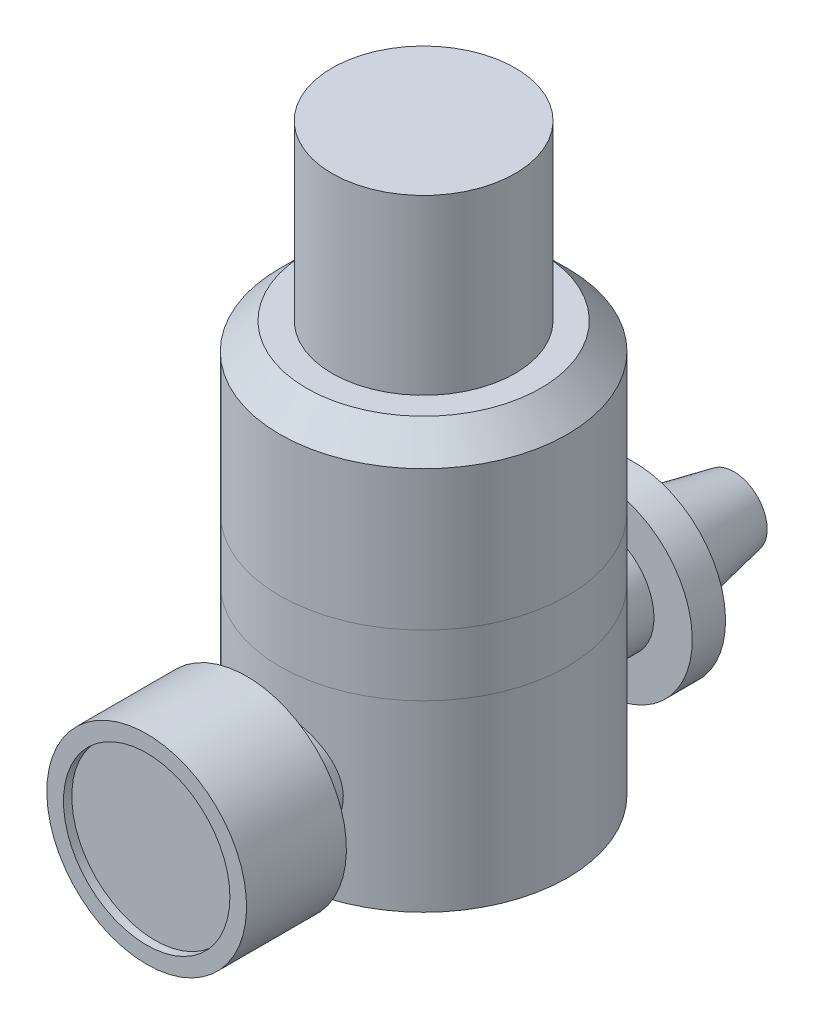
ISO-10303-21;
HEADER;
FILE_DESCRIPTION(('STEP AP214'),'2;1');
FILE_NAME('part.step','',(''),(''),'','','');
FILE_SCHEMA(('AUTOMOTIVE_DESIGN { 1 0 10303 214 1 1 1 1 }'));
ENDSEC;
DATA;
#1=APPLICATION_CONTEXT('core data for automotive mechanical design processes');
#2=APPLICATION_PROTOCOL_DEFINITION('international standard','automotive_design',2000,#1);
#3=PRODUCT_CONTEXT('',#1,'mechanical');
#4=PRODUCT('Part','Part','',(#3));
#5=PRODUCT_RELATED_PRODUCT_CATEGORY('part','',(#4));
#6=PRODUCT_DEFINITION_FORMATION('','',#4);
#7=PRODUCT_DEFINITION_CONTEXT('part definition',#1,'design');
#8=PRODUCT_DEFINITION('design','',#6,#7);
#9=PRODUCT_DEFINITION_SHAPE('','',#8);
#10=(LENGTH_UNIT() NAMED_UNIT(*) SI_UNIT(.MILLI.,.METRE.));
#11=(NAMED_UNIT(*) PLANE_ANGLE_UNIT() SI_UNIT($,.RADIAN.));
#12=(NAMED_UNIT(*) SI_UNIT($,.STERADIAN.) SOLID_ANGLE_UNIT());
#13=UNCERTAINTY_MEASURE_WITH_UNIT(LENGTH_MEASURE(1.E-05),#10,'distance_accuracy_value','');
#14=(GEOMETRIC_REPRESENTATION_CONTEXT(3) GLOBAL_UNCERTAINTY_ASSIGNED_CONTEXT((#13)) GLOBAL_UNIT_ASSIGNED_CONTEXT((#10,
#11,#12)) REPRESENTATION_CONTEXT('',''));
#15=CARTESIAN_POINT('',(0.,0.,0.));
#16=DIRECTION('',(0.,0.,1.));
#17=DIRECTION('',(1.,0.,0.));
#18=AXIS2_PLACEMENT_3D('',#15,#16,#17);
#19=CARTESIAN_POINT('',(0.,55.6895,0.));
#20=DIRECTION('',(0.,-1.,0.));
#21=DIRECTION('',(0.,0.,-1.));
#22=AXIS2_PLACEMENT_3D('',#19,#20,#21);
#23=CYLINDRICAL_SURFACE('',#22,8.73125);
#24=CARTESIAN_POINT('',(0.,55.6895,0.));
#25=DIRECTION('',(0.,1.,0.));
#26=DIRECTION('',(0.,0.,1.));
#27=AXIS2_PLACEMENT_3D('',#24,#25,#26);
#28=CIRCLE('',#27,8.73125);
#29=CARTESIAN_POINT('',(0.,55.6895,8.73125));
#30=VERTEX_POINT('',#29);
#31=EDGE_CURVE('E12',#30,#30,#28,.T.);
#32=ORIENTED_EDGE('',*,*,#31,.F.);
#33=EDGE_LOOP('',(#32));
#34=FACE_BOUND('',#33,.T.);
#35=CARTESIAN_POINT('',(0.,39.1795,0.));
#36=DIRECTION('',(0.,1.,0.));
#37=DIRECTION('',(0.,0.,1.));
#38=AXIS2_PLACEMENT_3D('',#35,#36,#37);
#39=CIRCLE('',#38,8.73125);
#40=CARTESIAN_POINT('',(0.,39.1795,8.73125));
#41=VERTEX_POINT('',#40);
#42=EDGE_CURVE('E49',#41,#41,#39,.T.);
#43=ORIENTED_EDGE('',*,*,#42,.T.);
#44=EDGE_LOOP('',(#43));
#45=FACE_BOUND('',#44,.T.);
#46=ADVANCED_FACE('F46',(#34,#45),#23,.T.);
#47=CARTESIAN_POINT('',(0.,55.6895,0.));
#48=DIRECTION('',(0.,1.,0.));
#49=DIRECTION('',(0.,0.,1.));
#50=AXIS2_PLACEMENT_3D('',#47,#48,#49);
#51=PLANE('',#50);
#52=ORIENTED_EDGE('',*,*,#31,.T.);
#53=EDGE_LOOP('',(#52));
#54=FACE_BOUND('',#53,.T.);
#55=ADVANCED_FACE('F61',(#54),#51,.T.);
#56=CARTESIAN_POINT('',(0.,39.1795,0.));
#57=DIRECTION('',(0.,1.,0.));
#58=DIRECTION('',(0.,0.,1.));
#59=AXIS2_PLACEMENT_3D('',#56,#57,#58);
#60=PLANE('',#59);
#61=ORIENTED_EDGE('',*,*,#42,.F.);
#62=EDGE_LOOP('',(#61));
#63=FACE_BOUND('',#62,.T.);
#64=ADVANCED_FACE('F59',(#63),#60,.F.);
#65=CLOSED_SHELL('',(#46,#55,#64));
#66=MANIFOLD_SOLID_BREP('B2',#65);
#67=CARTESIAN_POINT('',(0.,39.1795,0.));
#68=DIRECTION('',(0.,-1.,0.));
#69=DIRECTION('',(0.,0.,-1.));
#70=AXIS2_PLACEMENT_3D('',#67,#68,#69);
#71=CYLINDRICAL_SURFACE('',#70,13.716);
#72=CARTESIAN_POINT('',(0.,17.4625,0.));
#73=DIRECTION('',(0.,-1.,0.));
#74=DIRECTION('',(0.,0.,-1.));
#75=AXIS2_PLACEMENT_3D('',#72,#73,#74);
#76=CIRCLE('',#75,13.716);
#77=CARTESIAN_POINT('',(0.,17.4625,-13.716));
#78=VERTEX_POINT('',#77);
#79=EDGE_CURVE('E109',#78,#78,#76,.T.);
#80=ORIENTED_EDGE('',*,*,#79,.T.);
#81=EDGE_LOOP('',(#80));
#82=FACE_BOUND('',#81,.T.);
#83=CARTESIAN_POINT('',(0.,0.,0.));
#84=DIRECTION('',(0.,1.,0.));
#85=DIRECTION('',(0.,0.,1.));
#86=AXIS2_PLACEMENT_3D('',#83,#84,#85);
#87=CIRCLE('',#86,13.716);
#88=CARTESIAN_POINT('',(0.,0.,13.716));
#89=VERTEX_POINT('',#88);
#90=EDGE_CURVE('E113',#89,#89,#87,.T.);
#91=ORIENTED_EDGE('',*,*,#90,.T.);
#92=EDGE_LOOP('',(#91));
#93=FACE_BOUND('',#92,.T.);
#94=CARTESIAN_POINT('',(0.,3.65125,13.716));
#95=CARTESIAN_POINT('',(0.137644276268194,3.65124944146369,13.7160004090911));
#96=CARTESIAN_POINT('',(0.27528065400107,3.65684857647156,13.7139235511133));
#97=CARTESIAN_POINT('',(0.549569896814238,3.67918997001252,13.705672462848));
#98=CARTESIAN_POINT('',(0.686222427940242,3.69593584713162,13.6994969019935));
#99=CARTESIAN_POINT('',(0.957418986590382,3.7403962455868,13.6832178448485));
#100=CARTESIAN_POINT('',(1.09196404579344,3.76810521381685,13.6731163372034));
#101=CARTESIAN_POINT('',(1.35811299452666,3.83423644557649,13.6492508095649));
#102=CARTESIAN_POINT('',(1.48971572066765,3.87266286857515,13.635485367685));
#103=CARTESIAN_POINT('',(1.74874345976878,3.95978093891152,13.6046872871266));
#104=CARTESIAN_POINT('',(1.87617748138725,4.00844849175992,13.5876623255102));
#105=CARTESIAN_POINT('',(2.12639535280265,4.11568919315716,13.5507612605104));
#106=CARTESIAN_POINT('',(2.24917745805207,4.17426601371422,13.5308841006237));
#107=CARTESIAN_POINT('',(2.60936920057032,4.36419953166842,13.4677045608632));
#108=CARTESIAN_POINT('',(2.83882617702512,4.50982767196094,13.4208289512991));
#109=CARTESIAN_POINT('',(3.27897414528,4.84106129407934,13.320285933206));
#110=CARTESIAN_POINT('',(3.48863928942426,5.02796069183983,13.2664298012025));
#111=CARTESIAN_POINT('',(3.87457535729665,5.43392005054372,13.1588931689943));
#112=CARTESIAN_POINT('',(4.05083642052208,5.65298947394564,13.1052127252318));
#113=CARTESIAN_POINT('',(4.28956117910665,6.00593806208652,13.0282649774756));
#114=CARTESIAN_POINT('',(4.36598556535231,6.130118836098,13.0027869563939));
#115=CARTESIAN_POINT('',(4.50804201720736,6.38493389393125,12.9542209311094));
#116=CARTESIAN_POINT('',(4.57367840251274,6.51556556732295,12.931131971665));
#117=CARTESIAN_POINT('',(4.693610747287,6.78244745134227,12.8880852108681));
#118=CARTESIAN_POINT('',(4.74790529931328,6.91869835676839,12.8681277981951));
#119=CARTESIAN_POINT('',(4.84461093400312,7.19578247896662,12.832032830036));
#120=CARTESIAN_POINT('',(4.88702771048366,7.33661346393631,12.8158934448903));
#121=CARTESIAN_POINT('',(4.95811805563301,7.61615766946872,12.7885540426404));
#122=CARTESIAN_POINT('',(4.98727125917994,7.75473223097841,12.7771830587357));
#123=CARTESIAN_POINT('',(5.03392181899878,8.03406250949047,12.7588760204222));
#124=CARTESIAN_POINT('',(5.05142424387377,8.17481725071124,12.751938037515));
#125=CARTESIAN_POINT('',(5.07459577410278,8.45743062141391,12.7427347902604));
#126=CARTESIAN_POINT('',(5.0802665317341,8.59928909398357,12.7404688734654));
#127=CARTESIAN_POINT('',(5.07971424234369,8.88297629226629,12.7406891589719));
#128=CARTESIAN_POINT('',(5.07349164096283,9.02480501889479,12.7431751832196));
#129=CARTESIAN_POINT('',(5.04993549950784,9.29902603403016,12.7525273580316));
#130=CARTESIAN_POINT('',(5.03327226084147,9.43148557463436,12.7591291515628));
#131=CARTESIAN_POINT('',(4.9896259961107,9.694477840693,12.7762606934033));
#132=CARTESIAN_POINT('',(4.96263953675221,9.82500991009304,12.7867917484767));
#133=CARTESIAN_POINT('',(4.89860289105792,10.0832001676968,12.8114605703915));
#134=CARTESIAN_POINT('',(4.86155534142729,10.2108590993838,12.8255973922123));
#135=CARTESIAN_POINT('',(4.77772162465147,10.4625503655873,12.8570614181042));
#136=CARTESIAN_POINT('',(4.73093172352098,10.5865812887358,12.8743898451382));
#137=CARTESIAN_POINT('',(4.57459367650136,10.9565361127581,12.9311347651734));
#138=CARTESIAN_POINT('',(4.45021905457853,11.1957313010152,12.9748474197534));
#139=CARTESIAN_POINT('',(4.16609839479455,11.6505103085415,13.068840828357));
#140=CARTESIAN_POINT('',(4.00634035837105,11.8660860812828,13.1191238080091));
#141=CARTESIAN_POINT('',(3.64362081532082,12.282518243742,13.2246202775621));
#142=CARTESIAN_POINT('',(3.43851644182021,12.4814886430861,13.2799411049301));
#143=CARTESIAN_POINT('',(2.99721364187557,12.8427527859511,13.3864422695257));
#144=CARTESIAN_POINT('',(2.76101067623923,13.0050411659023,13.4376220005493));
#145=CARTESIAN_POINT('',(2.25948975468846,13.2903627578782,13.5310489078023));
#146=CARTESIAN_POINT('',(1.99379367046652,13.4127815068934,13.5731531605288));
#147=CARTESIAN_POINT('',(1.44363251542135,13.6105605738086,13.6426276546175));
#148=CARTESIAN_POINT('',(1.1591756268244,13.6859412585009,13.6700042721209));
#149=CARTESIAN_POINT('',(0.595471314349992,13.7839083366341,13.7058256253781));
#150=CARTESIAN_POINT('',(0.316723482866834,13.8090386240085,13.7151816585369));
#151=CARTESIAN_POINT('',(-0.241130033240432,13.813180153933,13.716714186533));
#152=CARTESIAN_POINT('',(-0.520235627896709,13.7922013248398,13.7088943797252));
#153=CARTESIAN_POINT('',(-1.05998420122372,13.7066630181399,13.6775553144716));
#154=CARTESIAN_POINT('',(-1.32092754427253,13.6437577952636,13.6546323480666));
#155=CARTESIAN_POINT('',(-1.82838099296593,13.4783206503388,13.5959911266259));
#156=CARTESIAN_POINT('',(-2.07488921572442,13.3757835719953,13.5602712066892));
#157=CARTESIAN_POINT('',(-2.55451574536986,13.1307348585615,13.4782806182033));
#158=CARTESIAN_POINT('',(-2.78703561395112,12.9871467367414,13.4317331567668));
#159=CARTESIAN_POINT('',(-3.22543123672895,12.6653375393479,13.3332601449431));
#160=CARTESIAN_POINT('',(-3.43129728328955,12.4871039042575,13.28133264741));
#161=CARTESIAN_POINT('',(-3.82281523696496,12.0890219490929,13.1741507557076));
#162=CARTESIAN_POINT('',(-4.00666494730666,11.8673899236562,13.1188743283823));
#163=CARTESIAN_POINT('',(-4.25271307283024,11.5136161387242,13.0403426860811));
#164=CARTESIAN_POINT('',(-4.32981192948891,11.3920581141212,13.0148820502735));
#165=CARTESIAN_POINT('',(-4.47357542042123,11.1425194873021,12.9661686439631));
#166=CARTESIAN_POINT('',(-4.5402444514679,11.0145416216308,12.9429149447441));
#167=CARTESIAN_POINT('',(-4.66283990511605,10.7524721356334,12.8992572247712));
#168=CARTESIAN_POINT('',(-4.71872473331843,10.6183592180165,12.8788643174071));
#169=CARTESIAN_POINT('',(-4.81891067330453,10.3454420912828,12.8417137253474));
#170=CARTESIAN_POINT('',(-4.86321669365513,10.2066398983487,12.8249545007515));
#171=CARTESIAN_POINT('',(-4.93981142453405,9.92536187457688,12.7956478284724));
#172=CARTESIAN_POINT('',(-4.97210355353016,9.782887101103,12.7830991827988));
#173=CARTESIAN_POINT('',(-5.02432849401957,9.4953624188726,12.7626630943706));
#174=CARTESIAN_POINT('',(-5.04426213799877,9.35031268424651,12.7547753376534));
#175=CARTESIAN_POINT('',(-5.07067882204903,9.06803981451923,12.7442951283017));
#176=CARTESIAN_POINT('',(-5.07793010783836,8.93089928149996,12.7414003881202));
#177=CARTESIAN_POINT('',(-5.08130325614836,8.65641040240937,12.7400556429347));
#178=CARTESIAN_POINT('',(-5.07742136189139,8.51906200182468,12.7416071382672));
#179=CARTESIAN_POINT('',(-5.05856531734855,8.24531620223427,12.749104857269));
#180=CARTESIAN_POINT('',(-5.04359634096278,8.1089183895863,12.7550490310472));
#181=CARTESIAN_POINT('',(-5.00272303792563,7.8379738306645,12.771135386968));
#182=CARTESIAN_POINT('',(-4.97681459452406,7.70342780095817,12.7812791494758));
#183=CARTESIAN_POINT('',(-4.91523863440434,7.44112062461807,12.8050826082696));
#184=CARTESIAN_POINT('',(-4.8798813973596,7.31327639631341,12.8186298151521));
#185=CARTESIAN_POINT('',(-4.7994225522473,7.06107285137736,12.8489703657778));
#186=CARTESIAN_POINT('',(-4.75431752452402,6.93671477507512,12.8657648484906));
#187=CARTESIAN_POINT('',(-4.60490506098456,6.57005212077781,12.9203252327252));
#188=CARTESIAN_POINT('',(-4.48645356324693,6.33396209568864,12.9622870694223));
#189=CARTESIAN_POINT('',(-4.20831545284056,5.87241867467655,13.0553158946645));
#190=CARTESIAN_POINT('',(-4.04682001923164,5.64813848329033,13.1067404023607));
#191=CARTESIAN_POINT('',(-3.68981125023199,5.22876082028394,13.2116782530205));
#192=CARTESIAN_POINT('',(-3.49428723944658,5.03367254253421,13.2651922473962));
#193=CARTESIAN_POINT('',(-3.17356226918958,4.76186789352706,13.3442947032033));
#194=CARTESIAN_POINT('',(-3.05887675434081,4.67282806782956,13.371112604556));
#195=CARTESIAN_POINT('',(-2.82206701531836,4.504739802143,13.4230868497579));
#196=CARTESIAN_POINT('',(-2.69994554576176,4.42568769521719,13.4482438017867));
#197=CARTESIAN_POINT('',(-2.44896516125546,4.27814125582549,13.4962053953791));
#198=CARTESIAN_POINT('',(-2.32010297071346,4.20965212137947,13.5190088769898));
#199=CARTESIAN_POINT('',(-2.05660533494498,4.08387713954181,13.5615939304525));
#200=CARTESIAN_POINT('',(-1.92197238905364,4.02658650064169,13.581376793942));
#201=CARTESIAN_POINT('',(-1.64323402203108,3.92198017918505,13.6179604843108));
#202=CARTESIAN_POINT('',(-1.498962344254,3.87506358883793,13.6346390130802));
#203=CARTESIAN_POINT('',(-1.20645053330229,3.79425811361509,13.6636276932328));
#204=CARTESIAN_POINT('',(-1.05821215380217,3.76036357025879,13.6759397418069));
#205=CARTESIAN_POINT('',(-0.759004332162935,3.70597095255717,13.6958038687388));
#206=CARTESIAN_POINT('',(-0.608035323035208,3.68547077300358,13.7033566951026));
#207=CARTESIAN_POINT('',(-0.304707558037933,3.65811127921214,13.7134542871119));
#208=CARTESIAN_POINT('',(-0.152348940871135,3.65125061820525,13.7159995472054));
#209=CARTESIAN_POINT('',(0.,3.65125,13.716));
#210=B_SPLINE_CURVE_WITH_KNOTS('',3,(#94,#95,#96,#97,#98,#99,#100,#101,#102,#103,#104,#105,#106,
#107,#108,#109,#110,#111,#112,#113,#114,#115,#116,#117,#118,#119,#120,#121,#122,#123,#124,#125,
#126,#127,#128,#129,#130,#131,#132,#133,#134,#135,#136,#137,#138,#139,#140,#141,#142,#143,#144,
#145,#146,#147,#148,#149,#150,#151,#152,#153,#154,#155,#156,#157,#158,#159,#160,#161,#162,#163,
#164,#165,#166,#167,#168,#169,#170,#171,#172,#173,#174,#175,#176,#177,#178,#179,#180,#181,#182,
#183,#184,#185,#186,#187,#188,#189,#190,#191,#192,#193,#194,#195,#196,#197,#198,#199,#200,#201,
#202,#203,#204,#205,#206,#207,#208,#209),.UNSPECIFIED.,.T.,.F.,(4,2,2,2,2,2,2,2,2,2,2,2,2,2,2,2,
2,2,2,2,2,2,2,2,2,2,2,2,2,2,2,2,2,2,2,2,2,2,2,2,2,2,2,2,2,2,2,2,2,2,2,2,2,2,2,2,2,4),(0.,
0.412790315571552,0.825714701367825,1.23843019687139,1.65130609163706,2.06322125440132,
2.4752893934036,3.29878931545901,4.15315787876636,5.00777825041081,5.45138896060873,
5.89482160661954,6.33830924689092,6.78158392833773,7.20722290136416,7.63267658141705,
8.05807084342649,8.48344916634333,8.88397820727302,9.2846405720242,9.68519803653778,
10.0859093076536,10.9014248375234,11.7172173343408,12.5863871904171,13.4556840526314,
14.3378058347588,15.219545405578,16.055387045515,16.8910487270889,17.6955493183054,
18.5001546141713,19.3281752621739,20.1564966417463,21.0316738314764,21.4697870895319,
21.9077151569911,22.3472999454585,22.7866980787529,23.2259710886191,23.6652145051871,
24.0767866182641,24.4884976284763,24.9000166304959,25.3116906339382,25.7112260830015,
26.110901922644,26.9096505723935,27.7495175991452,28.589648584252,29.0321496291925,
29.4744877372332,29.9170428292646,30.3594081484288,30.816613093434,31.2736191434985,
31.7305533480833,32.1874424326439),.UNSPECIFIED.);
#211=CARTESIAN_POINT('',(0.,3.65125,13.716));
#212=VERTEX_POINT('',#211);
#213=EDGE_CURVE('E105',#212,#212,#210,.T.);
#214=ORIENTED_EDGE('',*,*,#213,.F.);
#215=EDGE_LOOP('',(#214));
#216=FACE_BOUND('',#215,.T.);
#217=CARTESIAN_POINT('',(0.,13.81125,-13.716));
#218=CARTESIAN_POINT('',(0.137644276268194,13.8112505585363,-13.7160004090911));
#219=CARTESIAN_POINT('',(0.27528065400107,13.8056514235284,-13.7139235511133));
#220=CARTESIAN_POINT('',(0.549569896814237,13.7833100299875,-13.705672462848));
#221=CARTESIAN_POINT('',(0.686222427940242,13.7665641528684,-13.6994969019935));
#222=CARTESIAN_POINT('',(0.957418986590382,13.7221037544132,-13.6832178448485));
#223=CARTESIAN_POINT('',(1.09196404579344,13.6943947861832,-13.6731163372034));
#224=CARTESIAN_POINT('',(1.35811299452666,13.6282635544235,-13.6492508095649));
#225=CARTESIAN_POINT('',(1.48971572066765,13.5898371314248,-13.635485367685));
#226=CARTESIAN_POINT('',(1.74874345976878,13.5027190610885,-13.6046872871266));
#227=CARTESIAN_POINT('',(1.87617748138724,13.4540515082401,-13.5876623255102));
#228=CARTESIAN_POINT('',(2.12639535280265,13.3468108068428,-13.5507612605104));
#229=CARTESIAN_POINT('',(2.24917745805207,13.2882339862858,-13.5308841006237));
#230=CARTESIAN_POINT('',(2.60936920057032,13.0983004683316,-13.4677045608632));
#231=CARTESIAN_POINT('',(2.83882617702512,12.9526723280391,-13.4208289512991));
#232=CARTESIAN_POINT('',(3.27897414528,12.6214387059207,-13.320285933206));
#233=CARTESIAN_POINT('',(3.48863928942426,12.4345393081602,-13.2664298012025));
#234=CARTESIAN_POINT('',(3.87457535729665,12.0285799494563,-13.1588931689943));
#235=CARTESIAN_POINT('',(4.05083642052208,11.8095105260544,-13.1052127252318));
#236=CARTESIAN_POINT('',(4.28956117910665,11.4565619379135,-13.0282649774756));
#237=CARTESIAN_POINT('',(4.36598556535231,11.332381163902,-13.0027869563939));
#238=CARTESIAN_POINT('',(4.50804201720736,11.0775661060688,-12.9542209311094));
#239=CARTESIAN_POINT('',(4.57367840251274,10.946934432677,-12.931131971665));
#240=CARTESIAN_POINT('',(4.693610747287,10.6800525486577,-12.8880852108681));
#241=CARTESIAN_POINT('',(4.74790529931327,10.5438016432316,-12.8681277981951));
#242=CARTESIAN_POINT('',(4.84461093400311,10.2667175210334,-12.832032830036));
#243=CARTESIAN_POINT('',(4.88702771048366,10.1258865360637,-12.8158934448903));
#244=CARTESIAN_POINT('',(4.95811805563301,9.84634233053128,-12.7885540426404));
#245=CARTESIAN_POINT('',(4.98727125917994,9.7077677690216,-12.7771830587357));
#246=CARTESIAN_POINT('',(5.03392181899878,9.42843749050953,-12.7588760204222));
#247=CARTESIAN_POINT('',(5.05142424387377,9.28768274928876,-12.751938037515));
#248=CARTESIAN_POINT('',(5.07459577410278,9.00506937858609,-12.7427347902604));
#249=CARTESIAN_POINT('',(5.0802665317341,8.86321090601643,-12.7404688734654));
#250=CARTESIAN_POINT('',(5.07971424234369,8.57952370773371,-12.7406891589719));
#251=CARTESIAN_POINT('',(5.07349164096283,8.43769498110522,-12.7431751832196));
#252=CARTESIAN_POINT('',(5.04993549950784,8.16347396596984,-12.7525273580316));
#253=CARTESIAN_POINT('',(5.03327226084147,8.03101442536564,-12.7591291515628));
#254=CARTESIAN_POINT('',(4.9896259961107,7.768022159307,-12.7762606934033));
#255=CARTESIAN_POINT('',(4.9626395367522,7.63749008990696,-12.7867917484767));
#256=CARTESIAN_POINT('',(4.89860289105792,7.37929983230323,-12.8114605703915));
#257=CARTESIAN_POINT('',(4.86155534142728,7.25164090061618,-12.8255973922123));
#258=CARTESIAN_POINT('',(4.77772162465147,6.9999496344127,-12.8570614181042));
#259=CARTESIAN_POINT('',(4.73093172352098,6.87591871126424,-12.8743898451382));
#260=CARTESIAN_POINT('',(4.57459367650136,6.50596388724191,-12.9311347651734));
#261=CARTESIAN_POINT('',(4.45021905457853,6.26676869898477,-12.9748474197534));
#262=CARTESIAN_POINT('',(4.16609839479455,5.81198969145846,-13.068840828357));
#263=CARTESIAN_POINT('',(4.00634035837105,5.59641391871718,-13.1191238080091));
#264=CARTESIAN_POINT('',(3.64362081532082,5.17998175625804,-13.2246202775621));
#265=CARTESIAN_POINT('',(3.43851644182021,4.98101135691392,-13.2799411049301));
#266=CARTESIAN_POINT('',(2.99721364187558,4.61974721404894,-13.3864422695257));
#267=CARTESIAN_POINT('',(2.76101067623924,4.45745883409768,-13.4376220005493));
#268=CARTESIAN_POINT('',(2.25948975468846,4.17213724212185,-13.5310489078023));
#269=CARTESIAN_POINT('',(1.99379367046653,4.04971849310665,-13.5731531605288));
#270=CARTESIAN_POINT('',(1.44363251542135,3.85193942619145,-13.6426276546175));
#271=CARTESIAN_POINT('',(1.15917562682441,3.77655874149914,-13.6700042721209));
#272=CARTESIAN_POINT('',(0.595471314349997,3.67859166336595,-13.7058256253781));
#273=CARTESIAN_POINT('',(0.316723482866839,3.65346137599147,-13.7151816585369));
#274=CARTESIAN_POINT('',(-0.241130033240428,3.64931984606704,-13.716714186533));
#275=CARTESIAN_POINT('',(-0.520235627896705,3.67029867516016,-13.7088943797252));
#276=CARTESIAN_POINT('',(-1.05998420122372,3.75583698186014,-13.6775553144716));
#277=CARTESIAN_POINT('',(-1.32092754427253,3.81874220473644,-13.6546323480666));
#278=CARTESIAN_POINT('',(-1.82838099296593,3.9841793496612,-13.5959911266259));
#279=CARTESIAN_POINT('',(-2.07488921572442,4.08671642800471,-13.5602712066892));
#280=CARTESIAN_POINT('',(-2.55451574536986,4.33176514143847,-13.4782806182033));
#281=CARTESIAN_POINT('',(-2.78703561395112,4.47535326325858,-13.4317331567668));
#282=CARTESIAN_POINT('',(-3.22543123672895,4.79716246065214,-13.3332601449431));
#283=CARTESIAN_POINT('',(-3.43129728328954,4.97539609574249,-13.28133264741));
#284=CARTESIAN_POINT('',(-3.82281523696496,5.37347805090707,-13.1741507557076));
#285=CARTESIAN_POINT('',(-4.00666494730666,5.59511007634383,-13.1188743283823));
#286=CARTESIAN_POINT('',(-4.25271307283024,5.94888386127577,-13.0403426860811));
#287=CARTESIAN_POINT('',(-4.32981192948891,6.07044188587876,-13.0148820502735));
#288=CARTESIAN_POINT('',(-4.47357542042123,6.31998051269788,-12.9661686439631));
#289=CARTESIAN_POINT('',(-4.5402444514679,6.44795837836923,-12.9429149447441));
#290=CARTESIAN_POINT('',(-4.66283990511605,6.71002786436656,-12.8992572247712));
#291=CARTESIAN_POINT('',(-4.71872473331842,6.84414078198353,-12.8788643174071));
#292=CARTESIAN_POINT('',(-4.81891067330452,7.11705790871718,-12.8417137253474));
#293=CARTESIAN_POINT('',(-4.86321669365513,7.25586010165125,-12.8249545007515));
#294=CARTESIAN_POINT('',(-4.93981142453405,7.53713812542312,-12.7956478284724));
#295=CARTESIAN_POINT('',(-4.97210355353016,7.679612898897,-12.7830991827988));
#296=CARTESIAN_POINT('',(-5.02432849401957,7.96713758112739,-12.7626630943706));
#297=CARTESIAN_POINT('',(-5.04426213799877,8.11218731575349,-12.7547753376534));
#298=CARTESIAN_POINT('',(-5.07067882204903,8.39446018548076,-12.7442951283017));
#299=CARTESIAN_POINT('',(-5.07793010783836,8.53160071850003,-12.7414003881202));
#300=CARTESIAN_POINT('',(-5.08130325614836,8.80608959759062,-12.7400556429347));
#301=CARTESIAN_POINT('',(-5.07742136189139,8.94343799817532,-12.7416071382672));
#302=CARTESIAN_POINT('',(-5.05856531734855,9.21718379776573,-12.749104857269));
#303=CARTESIAN_POINT('',(-5.04359634096278,9.3535816104137,-12.7550490310472));
#304=CARTESIAN_POINT('',(-5.00272303792563,9.6245261693355,-12.771135386968));
#305=CARTESIAN_POINT('',(-4.97681459452406,9.75907219904182,-12.7812791494758));
#306=CARTESIAN_POINT('',(-4.91523863440434,10.0213793753819,-12.8050826082696));
#307=CARTESIAN_POINT('',(-4.8798813973596,10.1492236036866,-12.8186298151521));
#308=CARTESIAN_POINT('',(-4.7994225522473,10.4014271486226,-12.8489703657778));
#309=CARTESIAN_POINT('',(-4.75431752452402,10.5257852249249,-12.8657648484906));
#310=CARTESIAN_POINT('',(-4.60490506098456,10.8924478792222,-12.9203252327252));
#311=CARTESIAN_POINT('',(-4.48645356324693,11.1285379043114,-12.9622870694223));
#312=CARTESIAN_POINT('',(-4.20831545284057,11.5900813253234,-13.0553158946645));
#313=CARTESIAN_POINT('',(-4.04682001923164,11.8143615167097,-13.1067404023607));
#314=CARTESIAN_POINT('',(-3.68981125023199,12.2337391797161,-13.2116782530205));
#315=CARTESIAN_POINT('',(-3.49428723944658,12.4288274574658,-13.2651922473962));
#316=CARTESIAN_POINT('',(-3.17356226918959,12.7006321064729,-13.3442947032033));
#317=CARTESIAN_POINT('',(-3.05887675434082,12.7896719321704,-13.371112604556));
#318=CARTESIAN_POINT('',(-2.82206701531836,12.957760197857,-13.4230868497579));
#319=CARTESIAN_POINT('',(-2.69994554576177,13.0368123047828,-13.4482438017867));
#320=CARTESIAN_POINT('',(-2.44896516125546,13.1843587441745,-13.4962053953791));
#321=CARTESIAN_POINT('',(-2.32010297071346,13.2528478786205,-13.5190088769898));
#322=CARTESIAN_POINT('',(-2.05660533494498,13.3786228604582,-13.5615939304525));
#323=CARTESIAN_POINT('',(-1.92197238905365,13.4359134993583,-13.581376793942));
#324=CARTESIAN_POINT('',(-1.64323402203109,13.540519820815,-13.6179604843108));
#325=CARTESIAN_POINT('',(-1.49896234425401,13.5874364111621,-13.6346390130802));
#326=CARTESIAN_POINT('',(-1.20645053330229,13.6682418863849,-13.6636276932328));
#327=CARTESIAN_POINT('',(-1.05821215380217,13.7021364297412,-13.6759397418069));
#328=CARTESIAN_POINT('',(-0.759004332162941,13.7565290474428,-13.6958038687388));
#329=CARTESIAN_POINT('',(-0.608035323035215,13.7770292269964,-13.7033566951026));
#330=CARTESIAN_POINT('',(-0.304707558037937,13.8043887207879,-13.7134542871119));
#331=CARTESIAN_POINT('',(-0.152348940871137,13.8112493817947,-13.7159995472054));
#332=CARTESIAN_POINT('',(0.,13.81125,-13.716));
#333=B_SPLINE_CURVE_WITH_KNOTS('',3,(#217,#218,#219,#220,#221,#222,#223,#224,#225,#226,#227,
#228,#229,#230,#231,#232,#233,#234,#235,#236,#237,#238,#239,#240,#241,#242,#243,#244,#245,#246,
#247,#248,#249,#250,#251,#252,#253,#254,#255,#256,#257,#258,#259,#260,#261,#262,#263,#264,#265,
#266,#267,#268,#269,#270,#271,#272,#273,#274,#275,#276,#277,#278,#279,#280,#281,#282,#283,#284,
#285,#286,#287,#288,#289,#290,#291,#292,#293,#294,#295,#296,#297,#298,#299,#300,#301,#302,#303,
#304,#305,#306,#307,#308,#309,#310,#311,#312,#313,#314,#315,#316,#317,#318,#319,#320,#321,#322,
#323,#324,#325,#326,#327,#328,#329,#330,#331,#332),.UNSPECIFIED.,.T.,.F.,(4,2,2,2,2,2,2,2,2,2,2,
2,2,2,2,2,2,2,2,2,2,2,2,2,2,2,2,2,2,2,2,2,2,2,2,2,2,2,2,2,2,2,2,2,2,2,2,2,2,2,2,2,2,2,2,2,2,4),
(0.,0.412790315571552,0.825714701367825,1.23843019687139,1.65130609163706,2.06322125440132,
2.47528939340359,3.29878931545901,4.15315787876636,5.00777825041081,5.45138896060873,
5.89482160661954,6.33830924689092,6.78158392833773,7.20722290136416,7.63267658141705,
8.05807084342649,8.48344916634333,8.88397820727302,9.2846405720242,9.68519803653778,
10.0859093076536,10.9014248375234,11.7172173343408,12.5863871904171,13.4556840526314,
14.3378058347588,15.2195454055779,16.055387045515,16.8910487270889,17.6955493183054,
18.5001546141713,19.3281752621739,20.1564966417463,21.0316738314764,21.4697870895319,
21.9077151569911,22.3472999454585,22.7866980787529,23.2259710886191,23.6652145051871,
24.0767866182641,24.4884976284763,24.9000166304959,25.3116906339382,25.7112260830015,
26.110901922644,26.9096505723934,27.7495175991452,28.589648584252,29.0321496291925,
29.4744877372332,29.9170428292646,30.3594081484288,30.8166130934339,31.2736191434985,
31.7305533480833,32.1874424326439),.UNSPECIFIED.);
#334=CARTESIAN_POINT('',(0.,13.81125,-13.716));
#335=VERTEX_POINT('',#334);
#336=EDGE_CURVE('E45',#335,#335,#333,.T.);
#337=ORIENTED_EDGE('',*,*,#336,.F.);
#338=EDGE_LOOP('',(#337));
#339=FACE_BOUND('',#338,.T.);
#340=ADVANCED_FACE('F94',(#82,#93,#216,#339),#71,.T.);
#341=CARTESIAN_POINT('',(0.,17.4625,0.));
#342=DIRECTION('',(0.,-1.,0.));
#343=DIRECTION('',(0.,0.,-1.));
#344=AXIS2_PLACEMENT_3D('',#341,#342,#343);
#345=PLANE('',#344);
#346=ORIENTED_EDGE('',*,*,#79,.F.);
#347=EDGE_LOOP('',(#346));
#348=FACE_BOUND('',#347,.T.);
#349=ADVANCED_FACE('F96',(#348),#345,.F.);
#350=CARTESIAN_POINT('',(0.,0.,0.));
#351=DIRECTION('',(0.,1.,0.));
#352=DIRECTION('',(0.,0.,1.));
#353=AXIS2_PLACEMENT_3D('',#350,#351,#352);
#354=PLANE('',#353);
#355=ORIENTED_EDGE('',*,*,#90,.F.);
#356=EDGE_LOOP('',(#355));
#357=FACE_BOUND('',#356,.T.);
#358=ADVANCED_FACE('F127',(#357),#354,.F.);
#359=CARTESIAN_POINT('',(0.,8.73125,26.416));
#360=DIRECTION('',(0.,0.,1.));
#361=DIRECTION('',(0.,-1.,0.));
#362=AXIS2_PLACEMENT_3D('',#359,#360,#361);
#363=CYLINDRICAL_SURFACE('',#362,5.08);
#364=CARTESIAN_POINT('',(0.,8.73125,16.891));
#365=DIRECTION('',(0.,0.,1.));
#366=DIRECTION('',(0.,-1.,0.));
#367=AXIS2_PLACEMENT_3D('',#364,#365,#366);
#368=CIRCLE('',#367,5.08);
#369=CARTESIAN_POINT('',(0.,3.65125,16.891));
#370=VERTEX_POINT('',#369);
#371=EDGE_CURVE('E165',#370,#370,#368,.T.);
#372=ORIENTED_EDGE('',*,*,#371,.F.);
#373=EDGE_LOOP('',(#372));
#374=FACE_BOUND('',#373,.T.);
#375=ORIENTED_EDGE('',*,*,#213,.T.);
#376=EDGE_LOOP('',(#375));
#377=FACE_BOUND('',#376,.T.);
#378=ADVANCED_FACE('F122',(#374,#377),#363,.T.);
#379=CARTESIAN_POINT('',(0.,13.81125,16.891));
#380=DIRECTION('',(0.,0.,1.));
#381=DIRECTION('',(0.,-1.,0.));
#382=AXIS2_PLACEMENT_3D('',#379,#380,#381);
#383=PLANE('',#382);
#384=CARTESIAN_POINT('',(0.,8.73125,16.891));
#385=DIRECTION('',(0.,0.,1.));
#386=DIRECTION('',(0.,-1.,0.));
#387=AXIS2_PLACEMENT_3D('',#384,#385,#386);
#388=CIRCLE('',#387,9.525);
#389=CARTESIAN_POINT('',(0.,-0.793750000000003,16.891));
#390=VERTEX_POINT('',#389);
#391=EDGE_CURVE('E158',#390,#390,#388,.T.);
#392=ORIENTED_EDGE('',*,*,#391,.F.);
#393=EDGE_LOOP('',(#392));
#394=FACE_BOUND('',#393,.T.);
#395=ORIENTED_EDGE('',*,*,#371,.T.);
#396=EDGE_LOOP('',(#395));
#397=FACE_BOUND('',#396,.T.);
#398=ADVANCED_FACE('F126',(#394,#397),#383,.F.);
#399=CARTESIAN_POINT('',(0.,8.73125,26.416));
#400=DIRECTION('',(0.,0.,1.));
#401=DIRECTION('',(0.,-1.,0.));
#402=AXIS2_PLACEMENT_3D('',#399,#400,#401);
#403=CYLINDRICAL_SURFACE('',#402,9.525);
#404=CARTESIAN_POINT('',(0.,8.73125,26.416));
#405=DIRECTION('',(0.,0.,1.));
#406=DIRECTION('',(0.,-1.,0.));
#407=AXIS2_PLACEMENT_3D('',#404,#405,#406);
#408=CIRCLE('',#407,9.525);
#409=CARTESIAN_POINT('',(0.,-0.793750000000003,26.416));
#410=VERTEX_POINT('',#409);
#411=EDGE_CURVE('E160',#410,#410,#408,.T.);
#412=ORIENTED_EDGE('',*,*,#411,.F.);
#413=EDGE_LOOP('',(#412));
#414=FACE_BOUND('',#413,.T.);
#415=ORIENTED_EDGE('',*,*,#391,.T.);
#416=EDGE_LOOP('',(#415));
#417=FACE_BOUND('',#416,.T.);
#418=ADVANCED_FACE('F135',(#414,#417),#403,.T.);
#419=CARTESIAN_POINT('',(0.,18.25625,26.416));
#420=DIRECTION('',(0.,0.,-1.));
#421=DIRECTION('',(0.,1.,0.));
#422=AXIS2_PLACEMENT_3D('',#419,#420,#421);
#423=PLANE('',#422);
#424=CARTESIAN_POINT('',(0.,8.73125,26.416));
#425=DIRECTION('',(0.,0.,1.));
#426=DIRECTION('',(1.,0.,0.));
#427=AXIS2_PLACEMENT_3D('',#424,#425,#426);
#428=CIRCLE('',#427,7.9375);
#429=CARTESIAN_POINT('',(7.9375,8.73125,26.416));
#430=VERTEX_POINT('',#429);
#431=EDGE_CURVE('E184',#430,#430,#428,.T.);
#432=ORIENTED_EDGE('',*,*,#431,.F.);
#433=EDGE_LOOP('',(#432));
#434=FACE_BOUND('',#433,.T.);
#435=ORIENTED_EDGE('',*,*,#411,.T.);
#436=EDGE_LOOP('',(#435));
#437=FACE_BOUND('',#436,.T.);
#438=ADVANCED_FACE('F132',(#434,#437),#423,.F.);
#439=CARTESIAN_POINT('',(0.,8.73125,26.416));
#440=DIRECTION('',(0.,0.,1.));
#441=DIRECTION('',(0.,-1.,0.));
#442=AXIS2_PLACEMENT_3D('',#439,#440,#441);
#443=CYLINDRICAL_SURFACE('',#442,5.08);
#444=CARTESIAN_POINT('',(0.,8.73125,-16.891));
#445=DIRECTION('',(0.,0.,1.));
#446=DIRECTION('',(0.,-1.,0.));
#447=AXIS2_PLACEMENT_3D('',#444,#445,#446);
#448=CIRCLE('',#447,5.08);
#449=CARTESIAN_POINT('',(0.,3.65125,-16.891));
#450=VERTEX_POINT('',#449);
#451=EDGE_CURVE('E168',#450,#450,#448,.T.);
#452=ORIENTED_EDGE('',*,*,#451,.T.);
#453=EDGE_LOOP('',(#452));
#454=FACE_BOUND('',#453,.T.);
#455=ORIENTED_EDGE('',*,*,#336,.T.);
#456=EDGE_LOOP('',(#455));
#457=FACE_BOUND('',#456,.T.);
#458=ADVANCED_FACE('F129',(#454,#457),#443,.T.);
#459=CARTESIAN_POINT('',(0.,13.81125,-16.891));
#460=DIRECTION('',(0.,0.,-1.));
#461=DIRECTION('',(0.,1.,0.));
#462=AXIS2_PLACEMENT_3D('',#459,#460,#461);
#463=PLANE('',#462);
#464=ORIENTED_EDGE('',*,*,#451,.F.);
#465=EDGE_LOOP('',(#464));
#466=FACE_BOUND('',#465,.T.);
#467=CARTESIAN_POINT('',(0.,8.73125,-16.891));
#468=DIRECTION('',(0.,0.,1.));
#469=DIRECTION('',(0.,-1.,0.));
#470=AXIS2_PLACEMENT_3D('',#467,#468,#469);
#471=CIRCLE('',#470,8.73125);
#472=CARTESIAN_POINT('',(0.,0.,-16.891));
#473=VERTEX_POINT('',#472);
#474=EDGE_CURVE('E171',#473,#473,#471,.T.);
#475=ORIENTED_EDGE('',*,*,#474,.T.);
#476=EDGE_LOOP('',(#475));
#477=FACE_BOUND('',#476,.T.);
#478=ADVANCED_FACE('F222',(#466,#477),#463,.F.);
#479=CARTESIAN_POINT('',(0.,8.73125,26.416));
#480=DIRECTION('',(0.,0.,1.));
#481=DIRECTION('',(0.,-1.,0.));
#482=AXIS2_PLACEMENT_3D('',#479,#480,#481);
#483=CYLINDRICAL_SURFACE('',#482,8.73125);
#484=ORIENTED_EDGE('',*,*,#474,.F.);
#485=EDGE_LOOP('',(#484));
#486=FACE_BOUND('',#485,.T.);
#487=CARTESIAN_POINT('',(0.,8.73125,-20.066));
#488=DIRECTION('',(0.,0.,1.));
#489=DIRECTION('',(0.,-1.,0.));
#490=AXIS2_PLACEMENT_3D('',#487,#488,#489);
#491=CIRCLE('',#490,8.73125);
#492=CARTESIAN_POINT('',(0.,0.,-20.066));
#493=VERTEX_POINT('',#492);
#494=EDGE_CURVE('E174',#493,#493,#491,.T.);
#495=ORIENTED_EDGE('',*,*,#494,.T.);
#496=EDGE_LOOP('',(#495));
#497=FACE_BOUND('',#496,.T.);
#498=ADVANCED_FACE('F219',(#486,#497),#483,.T.);
#499=CARTESIAN_POINT('',(0.,17.4625,-20.066));
#500=DIRECTION('',(0.,0.,1.));
#501=DIRECTION('',(0.,-1.,0.));
#502=AXIS2_PLACEMENT_3D('',#499,#500,#501);
#503=PLANE('',#502);
#504=ORIENTED_EDGE('',*,*,#494,.F.);
#505=EDGE_LOOP('',(#504));
#506=FACE_BOUND('',#505,.T.);
#507=CARTESIAN_POINT('',(0.,8.73125,-20.066));
#508=DIRECTION('',(0.,0.,1.));
#509=DIRECTION('',(0.,-1.,0.));
#510=AXIS2_PLACEMENT_3D('',#507,#508,#509);
#511=CIRCLE('',#510,5.07999999999999);
#512=CARTESIAN_POINT('',(0.,3.65125000000001,-20.066));
#513=VERTEX_POINT('',#512);
#514=EDGE_CURVE('E177',#513,#513,#511,.T.);
#515=ORIENTED_EDGE('',*,*,#514,.T.);
#516=EDGE_LOOP('',(#515));
#517=FACE_BOUND('',#516,.T.);
#518=ADVANCED_FACE('F215',(#506,#517),#503,.F.);
#519=CARTESIAN_POINT('',(0.,8.73125,-29.591));
#520=DIRECTION('',(0.,0.,1.));
#521=DIRECTION('',(0.,-1.,0.));
#522=AXIS2_PLACEMENT_3D('',#519,#520,#521);
#523=CONICAL_SURFACE('',#522,3.175,0.19739555984988);
#524=ORIENTED_EDGE('',*,*,#514,.F.);
#525=EDGE_LOOP('',(#524));
#526=FACE_BOUND('',#525,.T.);
#527=CARTESIAN_POINT('',(0.,8.73125,-29.591));
#528=DIRECTION('',(0.,0.,1.));
#529=DIRECTION('',(0.,-1.,0.));
#530=AXIS2_PLACEMENT_3D('',#527,#528,#529);
#531=CIRCLE('',#530,3.175);
#532=CARTESIAN_POINT('',(0.,5.55625,-29.591));
#533=VERTEX_POINT('',#532);
#534=EDGE_CURVE('E180',#533,#533,#531,.T.);
#535=ORIENTED_EDGE('',*,*,#534,.T.);
#536=EDGE_LOOP('',(#535));
#537=FACE_BOUND('',#536,.T.);
#538=ADVANCED_FACE('F209',(#526,#537),#523,.T.);
#539=CARTESIAN_POINT('',(0.,11.90625,-29.591));
#540=DIRECTION('',(0.,0.,1.));
#541=DIRECTION('',(0.,-1.,0.));
#542=AXIS2_PLACEMENT_3D('',#539,#540,#541);
#543=PLANE('',#542);
#544=ORIENTED_EDGE('',*,*,#534,.F.);
#545=EDGE_LOOP('',(#544));
#546=FACE_BOUND('',#545,.T.);
#547=ADVANCED_FACE('F195',(#546),#543,.F.);
#548=CARTESIAN_POINT('',(0.,8.73125,25.62225));
#549=DIRECTION('',(0.,0.,1.));
#550=DIRECTION('',(1.,0.,0.));
#551=AXIS2_PLACEMENT_3D('',#548,#549,#550);
#552=CYLINDRICAL_SURFACE('',#551,7.9375);
#553=CARTESIAN_POINT('',(0.,8.73125,25.62225));
#554=DIRECTION('',(0.,0.,1.));
#555=DIRECTION('',(1.,0.,0.));
#556=AXIS2_PLACEMENT_3D('',#553,#554,#555);
#557=CIRCLE('',#556,7.9375);
#558=CARTESIAN_POINT('',(7.9375,8.73125,25.62225));
#559=VERTEX_POINT('',#558);
#560=EDGE_CURVE('E183',#559,#559,#557,.T.);
#561=ORIENTED_EDGE('',*,*,#560,.F.);
#562=EDGE_LOOP('',(#561));
#563=FACE_BOUND('',#562,.T.);
#564=ORIENTED_EDGE('',*,*,#431,.T.);
#565=EDGE_LOOP('',(#564));
#566=FACE_BOUND('',#565,.T.);
#567=ADVANCED_FACE('F192',(#563,#566),#552,.F.);
#568=CARTESIAN_POINT('',(0.,8.73125,25.62225));
#569=DIRECTION('',(0.,0.,1.));
#570=DIRECTION('',(1.,0.,0.));
#571=AXIS2_PLACEMENT_3D('',#568,#569,#570);
#572=PLANE('',#571);
#573=ORIENTED_EDGE('',*,*,#560,.T.);
#574=EDGE_LOOP('',(#573));
#575=FACE_BOUND('',#574,.T.);
#576=ADVANCED_FACE('F190',(#575),#572,.T.);
#577=CLOSED_SHELL('',(#340,#349,#358,#378,#398,#418,#438,#458,#478,#498,#518,#538,#547,#567,#576));
#578=MANIFOLD_SOLID_BREP('B7',#577);
#579=CARTESIAN_POINT('',(0.,23.3045,0.));
#580=DIRECTION('',(0.,-1.,0.));
#581=DIRECTION('',(0.,0.,-1.));
#582=AXIS2_PLACEMENT_3D('',#579,#580,#581);
#583=PLANE('',#582);
#584=CARTESIAN_POINT('',(0.,23.3045,0.));
#585=DIRECTION('',(0.,-1.,0.));
#586=DIRECTION('',(0.,0.,-1.));
#587=AXIS2_PLACEMENT_3D('',#584,#585,#586);
#588=CIRCLE('',#587,13.716);
#589=CARTESIAN_POINT('',(0.,23.3045,-13.716));
#590=VERTEX_POINT('',#589);
#591=EDGE_CURVE('E350',#590,#590,#588,.T.);
#592=ORIENTED_EDGE('',*,*,#591,.T.);
#593=EDGE_LOOP('',(#592));
#594=FACE_BOUND('',#593,.T.);
#595=ADVANCED_FACE('F346',(#594),#583,.T.);
#596=CARTESIAN_POINT('',(0.,39.1795,0.));
#597=DIRECTION('',(0.,-1.,0.));
#598=DIRECTION('',(0.,0.,-1.));
#599=AXIS2_PLACEMENT_3D('',#596,#597,#598);
#600=CYLINDRICAL_SURFACE('',#599,13.716);
#601=CARTESIAN_POINT('',(0.,36.6395,0.));
#602=DIRECTION('',(0.,1.,0.));
#603=DIRECTION('',(0.,0.,1.));
#604=AXIS2_PLACEMENT_3D('',#601,#602,#603);
#605=CIRCLE('',#604,13.716);
#606=CARTESIAN_POINT('',(0.,36.6395,13.716));
#607=VERTEX_POINT('',#606);
#608=EDGE_CURVE('E354',#607,#607,#605,.F.);
#609=ORIENTED_EDGE('',*,*,#608,.T.);
#610=EDGE_LOOP('',(#609));
#611=FACE_BOUND('',#610,.T.);
#612=ORIENTED_EDGE('',*,*,#591,.F.);
#613=EDGE_LOOP('',(#612));
#614=FACE_BOUND('',#613,.T.);
#615=ADVANCED_FACE('F348',(#611,#614),#600,.T.);
#616=CARTESIAN_POINT('',(0.,39.1795,0.));
#617=DIRECTION('',(0.,1.,0.));
#618=DIRECTION('',(0.,0.,1.));
#619=AXIS2_PLACEMENT_3D('',#616,#617,#618);
#620=PLANE('',#619);
#621=CARTESIAN_POINT('',(0.,39.1795,0.));
#622=DIRECTION('',(0.,1.,0.));
#623=DIRECTION('',(0.,0.,1.));
#624=AXIS2_PLACEMENT_3D('',#621,#622,#623);
#625=CIRCLE('',#624,11.176);
#626=CARTESIAN_POINT('',(0.,39.1795,11.176));
#627=VERTEX_POINT('',#626);
#628=EDGE_CURVE('E93',#627,#627,#625,.T.);
#629=ORIENTED_EDGE('',*,*,#628,.T.);
#630=EDGE_LOOP('',(#629));
#631=FACE_BOUND('',#630,.T.);
#632=ADVANCED_FACE('F366',(#631),#620,.T.);
#633=CARTESIAN_POINT('',(0.,39.1795,0.));
#634=DIRECTION('',(0.,-1.,0.));
#635=DIRECTION('',(0.,0.,-1.));
#636=AXIS2_PLACEMENT_3D('',#633,#634,#635);
#637=CONICAL_SURFACE('',#636,11.176,0.785398163397447);
#638=ORIENTED_EDGE('',*,*,#608,.F.);
#639=EDGE_LOOP('',(#638));
#640=FACE_BOUND('',#639,.T.);
#641=ORIENTED_EDGE('',*,*,#628,.F.);
#642=EDGE_LOOP('',(#641));
#643=FACE_BOUND('',#642,.T.);
#644=ADVANCED_FACE('F371',(#640,#643),#637,.T.);
#645=CLOSED_SHELL('',(#595,#615,#632,#644));
#646=MANIFOLD_SOLID_BREP('B40',#645);
#647=CARTESIAN_POINT('',(0.,23.3045,0.));
#648=DIRECTION('',(0.,-1.,0.));
#649=DIRECTION('',(0.,0.,-1.));
#650=AXIS2_PLACEMENT_3D('',#647,#648,#649);
#651=PLANE('',#650);
#652=CARTESIAN_POINT('',(0.,23.3045,0.));
#653=DIRECTION('',(0.,-1.,0.));
#654=DIRECTION('',(0.,0.,-1.));
#655=AXIS2_PLACEMENT_3D('',#652,#653,#654);
#656=CIRCLE('',#655,13.716);
#657=CARTESIAN_POINT('',(0.,23.3045,-13.716));
#658=VERTEX_POINT('',#657);
#659=EDGE_CURVE('E345',#658,#658,#656,.T.);
#660=ORIENTED_EDGE('',*,*,#659,.F.);
#661=EDGE_LOOP('',(#660));
#662=FACE_BOUND('',#661,.T.);
#663=ADVANCED_FACE('F401',(#662),#651,.F.);
#664=CARTESIAN_POINT('',(0.,17.4625,0.));
#665=DIRECTION('',(0.,-1.,0.));
#666=DIRECTION('',(0.,0.,-1.));
#667=AXIS2_PLACEMENT_3D('',#664,#665,#666);
#668=PLANE('',#667);
#669=CARTESIAN_POINT('',(0.,17.4625,0.));
#670=DIRECTION('',(0.,-1.,0.));
#671=DIRECTION('',(0.,0.,-1.));
#672=AXIS2_PLACEMENT_3D('',#669,#670,#671);
#673=CIRCLE('',#672,13.716);
#674=CARTESIAN_POINT('',(0.,17.4625,-13.716));
#675=VERTEX_POINT('',#674);
#676=EDGE_CURVE('E407',#675,#675,#673,.T.);
#677=ORIENTED_EDGE('',*,*,#676,.T.);
#678=EDGE_LOOP('',(#677));
#679=FACE_BOUND('',#678,.T.);
#680=ADVANCED_FACE('F413',(#679),#668,.T.);
#681=CARTESIAN_POINT('',(0.,39.1795,0.));
#682=DIRECTION('',(0.,-1.,0.));
#683=DIRECTION('',(0.,0.,-1.));
#684=AXIS2_PLACEMENT_3D('',#681,#682,#683);
#685=CYLINDRICAL_SURFACE('',#684,13.716);
#686=ORIENTED_EDGE('',*,*,#659,.T.);
#687=EDGE_LOOP('',(#686));
#688=FACE_BOUND('',#687,.T.);
#689=ORIENTED_EDGE('',*,*,#676,.F.);
#690=EDGE_LOOP('',(#689));
#691=FACE_BOUND('',#690,.T.);
#692=ADVANCED_FACE('F415',(#688,#691),#685,.T.);
#693=CLOSED_SHELL('',(#663,#680,#692));
#694=MANIFOLD_SOLID_BREP('B88',#693);
#695=ADVANCED_BREP_SHAPE_REPRESENTATION('',(#18,#66,#578,#646,#694),#14);
#696=SHAPE_DEFINITION_REPRESENTATION(#9,#695);
ENDSEC;
END-ISO-10303-21;
